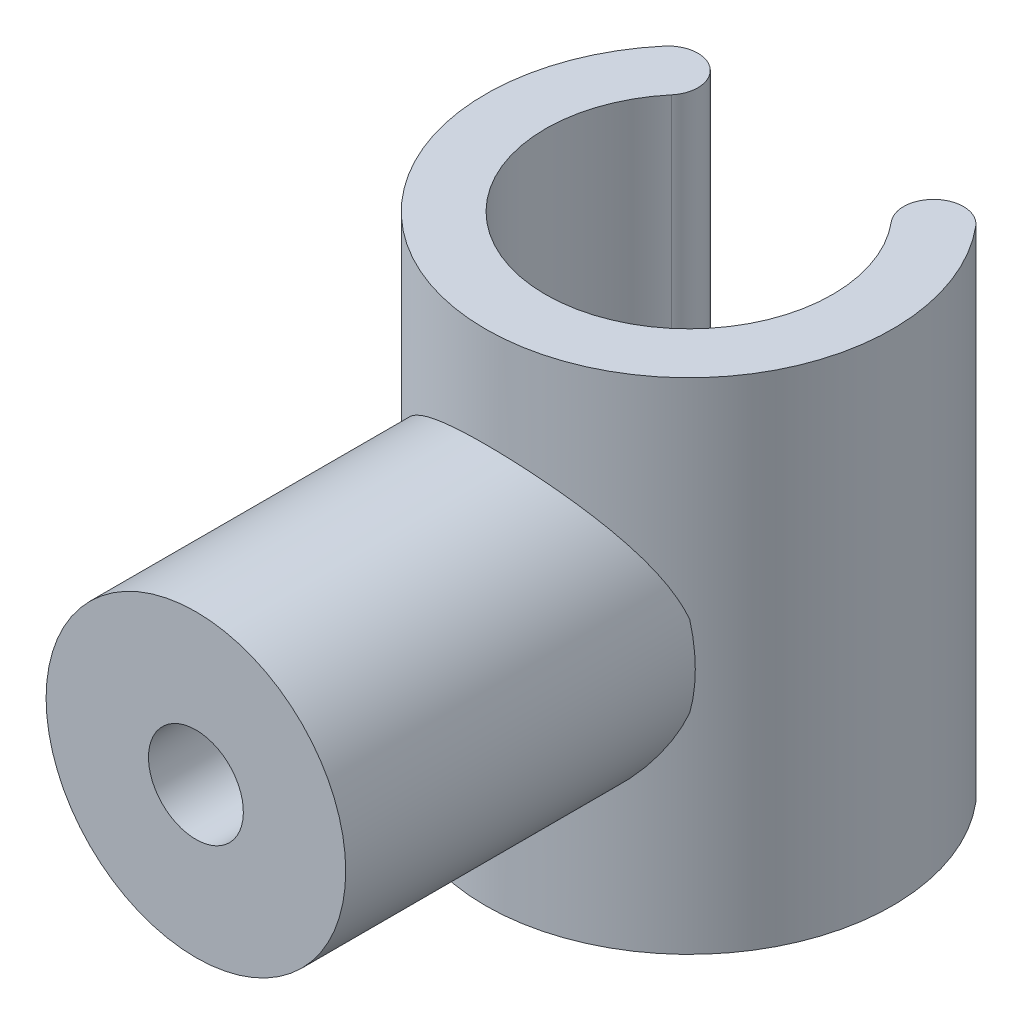
ISO-10303-21;
HEADER;
FILE_DESCRIPTION(('STEP AP214'),'2;1');
FILE_NAME('part.step','',(''),(''),'','','');
FILE_SCHEMA(('AUTOMOTIVE_DESIGN { 1 0 10303 214 1 1 1 1 }'));
ENDSEC;
DATA;
#1=APPLICATION_CONTEXT('core data for automotive mechanical design processes');
#2=APPLICATION_PROTOCOL_DEFINITION('international standard','automotive_design',2000,#1);
#3=PRODUCT_CONTEXT('',#1,'mechanical');
#4=PRODUCT('Part','Part','',(#3));
#5=PRODUCT_RELATED_PRODUCT_CATEGORY('part','',(#4));
#6=PRODUCT_DEFINITION_FORMATION('','',#4);
#7=PRODUCT_DEFINITION_CONTEXT('part definition',#1,'design');
#8=PRODUCT_DEFINITION('design','',#6,#7);
#9=PRODUCT_DEFINITION_SHAPE('','',#8);
#10=(LENGTH_UNIT() NAMED_UNIT(*) SI_UNIT(.MILLI.,.METRE.));
#11=(NAMED_UNIT(*) PLANE_ANGLE_UNIT() SI_UNIT($,.RADIAN.));
#12=(NAMED_UNIT(*) SI_UNIT($,.STERADIAN.) SOLID_ANGLE_UNIT());
#13=UNCERTAINTY_MEASURE_WITH_UNIT(LENGTH_MEASURE(1.E-05),#10,'distance_accuracy_value','');
#14=(GEOMETRIC_REPRESENTATION_CONTEXT(3) GLOBAL_UNCERTAINTY_ASSIGNED_CONTEXT((#13)) GLOBAL_UNIT_ASSIGNED_CONTEXT((#10,
#11,#12)) REPRESENTATION_CONTEXT('',''));
#15=CARTESIAN_POINT('',(0.,0.,0.));
#16=DIRECTION('',(0.,0.,1.));
#17=DIRECTION('',(1.,0.,0.));
#18=AXIS2_PLACEMENT_3D('',#15,#16,#17);
#19=CARTESIAN_POINT('',(0.,-5.,0.));
#20=DIRECTION('',(0.,-1.,0.));
#21=DIRECTION('',(1.,0.,0.));
#22=AXIS2_PLACEMENT_3D('',#19,#20,#21);
#23=PLANE('',#22);
#24=CARTESIAN_POINT('',(0.,-5.,0.));
#25=DIRECTION('',(0.,-1.,0.));
#26=DIRECTION('',(1.,0.,0.));
#27=AXIS2_PLACEMENT_3D('',#24,#25,#26);
#28=CIRCLE('',#27,4.075);
#29=CARTESIAN_POINT('',(3.11900642441656,-5.,-2.62248430394696));
#30=VERTEX_POINT('',#29);
#31=CARTESIAN_POINT('',(-3.11900642441657,-5.,-2.62248430394696));
#32=VERTEX_POINT('',#31);
#33=EDGE_CURVE('E223',#30,#32,#28,.T.);
#34=ORIENTED_EDGE('',*,*,#33,.T.);
#35=CARTESIAN_POINT('',(-2.65976621468652,-5.,-2.2363516456971));
#36=DIRECTION('',(0.,-1.,0.));
#37=DIRECTION('',(1.,0.,0.));
#38=AXIS2_PLACEMENT_3D('',#35,#36,#37);
#39=CIRCLE('',#38,0.6);
#40=CARTESIAN_POINT('',(-2.20013954881513,-5.,-2.62202421150903));
#41=VERTEX_POINT('',#40);
#42=EDGE_CURVE('E217',#32,#41,#39,.T.);
#43=ORIENTED_EDGE('',*,*,#42,.T.);
#44=CARTESIAN_POINT('',(-2.65976621468652,-5.,-2.2363516456971));
#45=DIRECTION('',(0.,-1.,0.));
#46=DIRECTION('',(1.,0.,0.));
#47=AXIS2_PLACEMENT_3D('',#44,#45,#46);
#48=CIRCLE('',#47,0.6);
#49=CARTESIAN_POINT('',(-2.20052600495647,-5.,-1.85021898744724));
#50=VERTEX_POINT('',#49);
#51=EDGE_CURVE('E62',#41,#50,#48,.T.);
#52=ORIENTED_EDGE('',*,*,#51,.T.);
#53=CARTESIAN_POINT('',(0.,-5.,0.));
#54=DIRECTION('',(0.,-1.,0.));
#55=DIRECTION('',(1.,0.,0.));
#56=AXIS2_PLACEMENT_3D('',#53,#54,#55);
#57=CIRCLE('',#56,2.875);
#58=CARTESIAN_POINT('',(2.20052600495647,-5.,-1.85021898744724));
#59=VERTEX_POINT('',#58);
#60=EDGE_CURVE('E140',#59,#50,#57,.T.);
#61=ORIENTED_EDGE('',*,*,#60,.F.);
#62=CARTESIAN_POINT('',(2.65976621468652,-5.,-2.2363516456971));
#63=DIRECTION('',(0.,-1.,0.));
#64=DIRECTION('',(1.,0.,0.));
#65=AXIS2_PLACEMENT_3D('',#62,#63,#64);
#66=CIRCLE('',#65,0.6);
#67=CARTESIAN_POINT('',(2.20013954881513,-5.,-2.62202421150903));
#68=VERTEX_POINT('',#67);
#69=EDGE_CURVE('E209',#59,#68,#66,.T.);
#70=ORIENTED_EDGE('',*,*,#69,.T.);
#71=CARTESIAN_POINT('',(2.65976621468652,-5.,-2.2363516456971));
#72=DIRECTION('',(0.,-1.,0.));
#73=DIRECTION('',(1.,0.,0.));
#74=AXIS2_PLACEMENT_3D('',#71,#72,#73);
#75=CIRCLE('',#74,0.6);
#76=EDGE_CURVE('E212',#68,#30,#75,.T.);
#77=ORIENTED_EDGE('',*,*,#76,.T.);
#78=EDGE_LOOP('',(#34,#43,#52,#61,#70,#77));
#79=FACE_BOUND('',#78,.T.);
#80=ADVANCED_FACE('F44',(#79),#23,.T.);
#81=CARTESIAN_POINT('',(0.,5.,0.));
#82=DIRECTION('',(0.,-1.,0.));
#83=DIRECTION('',(1.,0.,0.));
#84=AXIS2_PLACEMENT_3D('',#81,#82,#83);
#85=PLANE('',#84);
#86=CARTESIAN_POINT('',(-2.65976621468652,5.,-2.2363516456971));
#87=DIRECTION('',(0.,-1.,0.));
#88=DIRECTION('',(1.,0.,0.));
#89=AXIS2_PLACEMENT_3D('',#86,#87,#88);
#90=CIRCLE('',#89,0.6);
#91=CARTESIAN_POINT('',(-2.20052600495647,5.,-1.85021898744725));
#92=VERTEX_POINT('',#91);
#93=CARTESIAN_POINT('',(-2.20013954881513,5.,-2.62202421150903));
#94=VERTEX_POINT('',#93);
#95=EDGE_CURVE('E178',#92,#94,#90,.F.);
#96=ORIENTED_EDGE('',*,*,#95,.T.);
#97=CARTESIAN_POINT('',(-2.65976621468652,5.,-2.2363516456971));
#98=DIRECTION('',(0.,-1.,0.));
#99=DIRECTION('',(1.,0.,0.));
#100=AXIS2_PLACEMENT_3D('',#97,#98,#99);
#101=CIRCLE('',#100,0.6);
#102=CARTESIAN_POINT('',(-3.11900642441657,5.,-2.62248430394696));
#103=VERTEX_POINT('',#102);
#104=EDGE_CURVE('E182',#94,#103,#101,.F.);
#105=ORIENTED_EDGE('',*,*,#104,.T.);
#106=CARTESIAN_POINT('',(0.,5.,0.));
#107=DIRECTION('',(0.,-1.,0.));
#108=DIRECTION('',(1.,0.,0.));
#109=AXIS2_PLACEMENT_3D('',#106,#107,#108);
#110=CIRCLE('',#109,4.075);
#111=CARTESIAN_POINT('',(3.11900642441656,5.,-2.62248430394697));
#112=VERTEX_POINT('',#111);
#113=EDGE_CURVE('E225',#112,#103,#110,.T.);
#114=ORIENTED_EDGE('',*,*,#113,.F.);
#115=CARTESIAN_POINT('',(2.65976621468652,5.,-2.23635164569711));
#116=DIRECTION('',(0.,-1.,0.));
#117=DIRECTION('',(1.,0.,0.));
#118=AXIS2_PLACEMENT_3D('',#115,#116,#117);
#119=CIRCLE('',#118,0.6);
#120=CARTESIAN_POINT('',(2.20013954881513,5.,-2.62202421150903));
#121=VERTEX_POINT('',#120);
#122=EDGE_CURVE('E187',#112,#121,#119,.F.);
#123=ORIENTED_EDGE('',*,*,#122,.T.);
#124=CARTESIAN_POINT('',(2.65976621468652,5.,-2.23635164569711));
#125=DIRECTION('',(0.,-1.,0.));
#126=DIRECTION('',(1.,0.,0.));
#127=AXIS2_PLACEMENT_3D('',#124,#125,#126);
#128=CIRCLE('',#127,0.6);
#129=CARTESIAN_POINT('',(2.20052600495647,5.,-1.85021898744725));
#130=VERTEX_POINT('',#129);
#131=EDGE_CURVE('E233',#121,#130,#128,.F.);
#132=ORIENTED_EDGE('',*,*,#131,.T.);
#133=CARTESIAN_POINT('',(0.,5.,0.));
#134=DIRECTION('',(0.,-1.,0.));
#135=DIRECTION('',(1.,0.,0.));
#136=AXIS2_PLACEMENT_3D('',#133,#134,#135);
#137=CIRCLE('',#136,2.875);
#138=EDGE_CURVE('E135',#130,#92,#137,.T.);
#139=ORIENTED_EDGE('',*,*,#138,.T.);
#140=EDGE_LOOP('',(#96,#105,#114,#123,#132,#139));
#141=FACE_BOUND('',#140,.T.);
#142=ADVANCED_FACE('F170',(#141),#85,.F.);
#143=CARTESIAN_POINT('',(0.,-5.,0.));
#144=DIRECTION('',(0.,1.,0.));
#145=DIRECTION('',(-1.,0.,0.));
#146=AXIS2_PLACEMENT_3D('',#143,#144,#145);
#147=CYLINDRICAL_SURFACE('',#146,4.075);
#148=CARTESIAN_POINT('',(2.88790581563873,-0.812403840463599,2.875));
#149=CARTESIAN_POINT('',(2.86396987335777,-0.897453284394713,2.89904984617288));
#150=CARTESIAN_POINT('',(2.8365410358721,-0.980582858815973,2.9259981833262));
#151=CARTESIAN_POINT('',(2.77521081091253,-1.1426790618383,2.9842252696767));
#152=CARTESIAN_POINT('',(2.74132052686743,-1.2216525395088,3.01549656526744));
#153=CARTESIAN_POINT('',(2.66755311843785,-1.37528525505905,3.08094386239194));
#154=CARTESIAN_POINT('',(2.62768534592957,-1.44995098416575,3.1151152910095));
#155=CARTESIAN_POINT('',(2.54221793107529,-1.59506134909615,3.18524978771818));
#156=CARTESIAN_POINT('',(2.49661555196243,-1.66550394562205,3.22121370627193));
#157=CARTESIAN_POINT('',(2.35215234253959,-1.8695058096925,3.32977646102683));
#158=CARTESIAN_POINT('',(2.24512126426353,-1.99679729167083,3.40352574297608));
#159=CARTESIAN_POINT('',(2.01026162839675,-2.23306280346649,3.5473171158555));
#160=CARTESIAN_POINT('',(1.88242829260121,-2.34203261314063,3.61735835014989));
#161=CARTESIAN_POINT('',(1.62244812061208,-2.52789559651073,3.74053719482807));
#162=CARTESIAN_POINT('',(1.49238205711021,-2.60701306321136,3.79468919471361));
#163=CARTESIAN_POINT('',(1.21816452406372,-2.74583079814262,3.89136554152056));
#164=CARTESIAN_POINT('',(1.07402526042738,-2.80554770161209,3.93389984515969));
#165=CARTESIAN_POINT('',(0.849133978576695,-2.87841739896584,3.98630590120425));
#166=CARTESIAN_POINT('',(0.772342912189284,-2.89998413772647,4.00192127508929));
#167=CARTESIAN_POINT('',(0.616587043103844,-2.93704195364046,4.02885537442209));
#168=CARTESIAN_POINT('',(0.537623375764297,-2.95253614199359,4.04017629998419));
#169=CARTESIAN_POINT('',(0.378214827153008,-2.9771552833664,4.05820257518367));
#170=CARTESIAN_POINT('',(0.297770523200099,-2.98628266705923,4.06490968623662));
#171=CARTESIAN_POINT('',(0.136180671361998,-2.99800395355235,4.07352912946396));
#172=CARTESIAN_POINT('',(0.0550352227760893,-3.00059876678596,4.07544212978531));
#173=CARTESIAN_POINT('',(-0.166424725485071,-2.99865452277607,4.07400718415628));
#174=CARTESIAN_POINT('',(-0.306732934675275,-2.98753283705214,4.06580511493588));
#175=CARTESIAN_POINT('',(-0.582841730451785,-2.94615546987724,4.03550076286465));
#176=CARTESIAN_POINT('',(-0.718641941200782,-2.91589819726477,4.01339732408859));
#177=CARTESIAN_POINT('',(-0.981296699021089,-2.83824899253106,3.95734353287424));
#178=CARTESIAN_POINT('',(-1.10821751309609,-2.7910049986219,3.92349555063636));
#179=CARTESIAN_POINT('',(-1.35211950668457,-2.68135662622725,3.84626903740088));
#180=CARTESIAN_POINT('',(-1.46910013379195,-2.61895140592957,3.80288997721233));
#181=CARTESIAN_POINT('',(-1.70756308655748,-2.47115220306957,3.70254811320194));
#182=CARTESIAN_POINT('',(-1.8273544699331,-2.38375748511809,3.64453242110091));
#183=CARTESIAN_POINT('',(-2.05157956416729,-2.19378235083266,3.52319879903805));
#184=CARTESIAN_POINT('',(-2.15598082321219,-2.09117073608246,3.45987009474344));
#185=CARTESIAN_POINT('',(-2.30973124710229,-1.91643096155526,3.3579059581445));
#186=CARTESIAN_POINT('',(-2.36432373066228,-1.84865961741318,3.31959248315098));
#187=CARTESIAN_POINT('',(-2.46757347071481,-1.70841353961342,3.24358277328851));
#188=CARTESIAN_POINT('',(-2.51622850859452,-1.63593706321784,3.20588677367565));
#189=CARTESIAN_POINT('',(-2.65265498041123,-1.41204032010555,3.09557520389261));
#190=CARTESIAN_POINT('',(-2.73143027027953,-1.25353890980507,3.02535910804588));
#191=CARTESIAN_POINT('',(-2.81358767936852,-1.04211498087328,2.94786908207971));
#192=CARTESIAN_POINT('',(-2.82989564809637,-0.997002922802062,2.93219709791875));
#193=CARTESIAN_POINT('',(-2.86045906191798,-0.905590905107362,2.90238628679099));
#194=CARTESIAN_POINT('',(-2.8747143759611,-0.85929086986026,2.88824755772824));
#195=CARTESIAN_POINT('',(-2.88790581563873,-0.812403840463599,2.875));
#196=B_SPLINE_CURVE_WITH_KNOTS('',3,(#148,#149,#150,#151,#152,#153,#154,#155,#156,#157,#158,
#159,#160,#161,#162,#163,#164,#165,#166,#167,#168,#169,#170,#171,#172,#173,#174,#175,#176,#177,
#178,#179,#180,#181,#182,#183,#184,#185,#186,#187,#188,#189,#190,#191,#192,#193,#194,#195),
.UNSPECIFIED.,.F.,.F.,(4,2,2,2,2,2,2,2,2,2,2,2,2,2,2,2,2,2,2,2,2,2,2,4),(0.,0.27441510762216,
0.54836283922251,0.821886363208285,1.09554092170355,1.63907956269224,2.18274322926595,
2.66561366767767,3.14806896364641,3.3915877967518,3.63498170223898,3.87828263560953,
4.12154965866139,4.54222622834102,4.96293778270041,5.38007072589025,5.7972268352725,
6.2732018086239,6.75016649740683,7.03512834484124,7.32019634846556,7.8876538296769,
8.03899172374996,8.19033927562882),.UNSPECIFIED.);
#197=CARTESIAN_POINT('',(2.88790581563873,-0.812403840463599,2.875));
#198=VERTEX_POINT('',#197);
#199=CARTESIAN_POINT('',(-2.88790581563873,-0.812403840463599,2.875));
#200=VERTEX_POINT('',#199);
#201=EDGE_CURVE('E127',#198,#200,#196,.T.);
#202=ORIENTED_EDGE('',*,*,#201,.T.);
#203=DIRECTION('',(0.,1.,0.));
#204=VECTOR('',#203,1.);
#205=CARTESIAN_POINT('',(-2.88790581563873,-5.,2.875));
#206=LINE('',#205,#204);
#207=CARTESIAN_POINT('',(-2.88790581563873,0.8124038404636,2.875));
#208=VERTEX_POINT('',#207);
#209=EDGE_CURVE('E119',#200,#208,#206,.T.);
#210=ORIENTED_EDGE('',*,*,#209,.T.);
#211=CARTESIAN_POINT('',(-2.88790581563873,0.8124038404636,2.875));
#212=CARTESIAN_POINT('',(-2.86396987335777,0.897453284394714,2.89904984617288));
#213=CARTESIAN_POINT('',(-2.8365410358721,0.980582858815974,2.9259981833262));
#214=CARTESIAN_POINT('',(-2.77521081091253,1.14267906183831,2.9842252696767));
#215=CARTESIAN_POINT('',(-2.74132052686743,1.2216525395088,3.01549656526744));
#216=CARTESIAN_POINT('',(-2.66755311843785,1.37528525505905,3.08094386239194));
#217=CARTESIAN_POINT('',(-2.62768534592957,1.44995098416575,3.1151152910095));
#218=CARTESIAN_POINT('',(-2.54221793107529,1.59506134909615,3.18524978771818));
#219=CARTESIAN_POINT('',(-2.49661555196243,1.66550394562205,3.22121370627193));
#220=CARTESIAN_POINT('',(-2.35215234253959,1.8695058096925,3.32977646102683));
#221=CARTESIAN_POINT('',(-2.24512126426353,1.99679729167083,3.40352574297608));
#222=CARTESIAN_POINT('',(-2.01026162839675,2.23306280346649,3.5473171158555));
#223=CARTESIAN_POINT('',(-1.88242829260121,2.34203261314063,3.61735835014989));
#224=CARTESIAN_POINT('',(-1.62244812061208,2.52789559651073,3.74053719482807));
#225=CARTESIAN_POINT('',(-1.49238205711021,2.60701306321136,3.79468919471361));
#226=CARTESIAN_POINT('',(-1.21816452406372,2.74583079814262,3.89136554152056));
#227=CARTESIAN_POINT('',(-1.07402526042738,2.80554770161209,3.93389984515969));
#228=CARTESIAN_POINT('',(-0.849133978576695,2.87841739896584,3.98630590120425));
#229=CARTESIAN_POINT('',(-0.772342912189283,2.89998413772647,4.00192127508929));
#230=CARTESIAN_POINT('',(-0.616587043103844,2.93704195364046,4.02885537442209));
#231=CARTESIAN_POINT('',(-0.537623375764296,2.95253614199359,4.04017629998419));
#232=CARTESIAN_POINT('',(-0.378214827153008,2.9771552833664,4.05820257518367));
#233=CARTESIAN_POINT('',(-0.297770523200098,2.98628266705923,4.06490968623662));
#234=CARTESIAN_POINT('',(-0.136180671361998,2.99800395355235,4.07352912946396));
#235=CARTESIAN_POINT('',(-0.0550352227760893,3.00059876678596,4.07544212978531));
#236=CARTESIAN_POINT('',(0.166424725485071,2.99865452277607,4.07400718415628));
#237=CARTESIAN_POINT('',(0.306732934675275,2.98753283705214,4.06580511493588));
#238=CARTESIAN_POINT('',(0.582841730451785,2.94615546987724,4.03550076286465));
#239=CARTESIAN_POINT('',(0.718641941200782,2.91589819726477,4.01339732408859));
#240=CARTESIAN_POINT('',(0.981296699021089,2.83824899253106,3.95734353287424));
#241=CARTESIAN_POINT('',(1.10821751309609,2.7910049986219,3.92349555063636));
#242=CARTESIAN_POINT('',(1.35211950668457,2.68135662622725,3.84626903740088));
#243=CARTESIAN_POINT('',(1.46910013379195,2.61895140592957,3.80288997721233));
#244=CARTESIAN_POINT('',(1.70756308655748,2.47115220306957,3.70254811320194));
#245=CARTESIAN_POINT('',(1.8273544699331,2.38375748511809,3.64453242110091));
#246=CARTESIAN_POINT('',(2.05157956416729,2.19378235083266,3.52319879903805));
#247=CARTESIAN_POINT('',(2.15598082321219,2.09117073608246,3.45987009474344));
#248=CARTESIAN_POINT('',(2.30973124710229,1.91643096155526,3.3579059581445));
#249=CARTESIAN_POINT('',(2.36432373066228,1.84865961741318,3.31959248315098));
#250=CARTESIAN_POINT('',(2.46757347071481,1.70841353961342,3.24358277328851));
#251=CARTESIAN_POINT('',(2.51622850859452,1.63593706321784,3.20588677367565));
#252=CARTESIAN_POINT('',(2.65265498041123,1.41204032010555,3.09557520389261));
#253=CARTESIAN_POINT('',(2.73143027027953,1.25353890980507,3.02535910804588));
#254=CARTESIAN_POINT('',(2.81358767936852,1.04211498087328,2.94786908207971));
#255=CARTESIAN_POINT('',(2.82989564809637,0.997002922802063,2.93219709791875));
#256=CARTESIAN_POINT('',(2.86045906191798,0.905590905107363,2.90238628679099));
#257=CARTESIAN_POINT('',(2.8747143759611,0.85929086986026,2.88824755772824));
#258=CARTESIAN_POINT('',(2.88790581563873,0.812403840463599,2.875));
#259=B_SPLINE_CURVE_WITH_KNOTS('',3,(#211,#212,#213,#214,#215,#216,#217,#218,#219,#220,#221,
#222,#223,#224,#225,#226,#227,#228,#229,#230,#231,#232,#233,#234,#235,#236,#237,#238,#239,#240,
#241,#242,#243,#244,#245,#246,#247,#248,#249,#250,#251,#252,#253,#254,#255,#256,#257,#258),
.UNSPECIFIED.,.F.,.F.,(4,2,2,2,2,2,2,2,2,2,2,2,2,2,2,2,2,2,2,2,2,2,2,4),(0.,0.27441510762216,
0.54836283922251,0.821886363208286,1.09554092170355,1.63907956269224,2.18274322926595,
2.66561366767767,3.14806896364641,3.3915877967518,3.63498170223898,3.87828263560953,
4.12154965866139,4.54222622834102,4.96293778270041,5.38007072589025,5.7972268352725,
6.2732018086239,6.75016649740683,7.03512834484124,7.32019634846556,7.8876538296769,
8.03899172374996,8.19033927562882),.UNSPECIFIED.);
#260=CARTESIAN_POINT('',(2.88790581563873,0.8124038404636,2.875));
#261=VERTEX_POINT('',#260);
#262=EDGE_CURVE('E125',#208,#261,#259,.T.);
#263=ORIENTED_EDGE('',*,*,#262,.T.);
#264=DIRECTION('',(0.,1.,0.));
#265=VECTOR('',#264,1.);
#266=CARTESIAN_POINT('',(2.88790581563873,-5.,2.875));
#267=LINE('',#266,#265);
#268=EDGE_CURVE('E110',#261,#198,#267,.F.);
#269=ORIENTED_EDGE('',*,*,#268,.T.);
#270=EDGE_LOOP('',(#202,#210,#263,#269));
#271=FACE_BOUND('',#270,.T.);
#272=ORIENTED_EDGE('',*,*,#113,.T.);
#273=DIRECTION('',(0.,1.,0.));
#274=VECTOR('',#273,1.);
#275=CARTESIAN_POINT('',(-3.11900642441657,-5.,-2.62248430394696));
#276=LINE('',#275,#274);
#277=EDGE_CURVE('E198',#103,#32,#276,.F.);
#278=ORIENTED_EDGE('',*,*,#277,.T.);
#279=ORIENTED_EDGE('',*,*,#33,.F.);
#280=DIRECTION('',(0.,1.,0.));
#281=VECTOR('',#280,1.);
#282=CARTESIAN_POINT('',(3.11900642441656,-5.,-2.62248430394696));
#283=LINE('',#282,#281);
#284=EDGE_CURVE('E200',#30,#112,#283,.T.);
#285=ORIENTED_EDGE('',*,*,#284,.T.);
#286=EDGE_LOOP('',(#272,#278,#279,#285));
#287=FACE_BOUND('',#286,.T.);
#288=ADVANCED_FACE('F132',(#271,#287),#147,.T.);
#289=CARTESIAN_POINT('',(0.,-5.,0.));
#290=DIRECTION('',(0.,1.,0.));
#291=DIRECTION('',(-1.,0.,0.));
#292=AXIS2_PLACEMENT_3D('',#289,#290,#291);
#293=CYLINDRICAL_SURFACE('',#292,2.875);
#294=ORIENTED_EDGE('',*,*,#60,.T.);
#295=DIRECTION('',(0.,1.,0.));
#296=VECTOR('',#295,1.);
#297=CARTESIAN_POINT('',(-2.20052600495647,-5.,-1.85021898744724));
#298=LINE('',#297,#296);
#299=EDGE_CURVE('E11',#50,#92,#298,.T.);
#300=ORIENTED_EDGE('',*,*,#299,.T.);
#301=ORIENTED_EDGE('',*,*,#138,.F.);
#302=DIRECTION('',(0.,1.,0.));
#303=VECTOR('',#302,1.);
#304=CARTESIAN_POINT('',(2.20052600495647,-5.,-1.85021898744724));
#305=LINE('',#304,#303);
#306=EDGE_CURVE('E54',#130,#59,#305,.F.);
#307=ORIENTED_EDGE('',*,*,#306,.T.);
#308=EDGE_LOOP('',(#294,#300,#301,#307));
#309=FACE_BOUND('',#308,.T.);
#310=ADVANCED_FACE('F163',(#309),#293,.F.);
#311=CARTESIAN_POINT('',(0.,0.,9.875));
#312=DIRECTION('',(0.,0.,-1.));
#313=DIRECTION('',(0.,1.,0.));
#314=AXIS2_PLACEMENT_3D('',#311,#312,#313);
#315=CYLINDRICAL_SURFACE('',#314,3.);
#316=CARTESIAN_POINT('',(0.,0.,9.875));
#317=DIRECTION('',(0.,0.,-1.));
#318=DIRECTION('',(0.,1.,0.));
#319=AXIS2_PLACEMENT_3D('',#316,#317,#318);
#320=CIRCLE('',#319,3.);
#321=CARTESIAN_POINT('',(0.,3.,9.875));
#322=VERTEX_POINT('',#321);
#323=EDGE_CURVE('E120',#322,#322,#320,.T.);
#324=ORIENTED_EDGE('',*,*,#323,.T.);
#325=EDGE_LOOP('',(#324));
#326=FACE_BOUND('',#325,.T.);
#327=ORIENTED_EDGE('',*,*,#262,.F.);
#328=CARTESIAN_POINT('',(0.,0.,2.875));
#329=DIRECTION('',(0.,0.,-1.));
#330=DIRECTION('',(0.,1.,0.));
#331=AXIS2_PLACEMENT_3D('',#328,#329,#330);
#332=CIRCLE('',#331,3.);
#333=EDGE_CURVE('E129',#200,#208,#332,.T.);
#334=ORIENTED_EDGE('',*,*,#333,.F.);
#335=ORIENTED_EDGE('',*,*,#201,.F.);
#336=EDGE_CURVE('E113',#261,#198,#332,.T.);
#337=ORIENTED_EDGE('',*,*,#336,.F.);
#338=EDGE_LOOP('',(#327,#334,#335,#337));
#339=FACE_BOUND('',#338,.T.);
#340=ADVANCED_FACE('F123',(#326,#339),#315,.T.);
#341=CARTESIAN_POINT('',(0.,0.,2.875));
#342=DIRECTION('',(0.,0.,-1.));
#343=DIRECTION('',(0.,1.,0.));
#344=AXIS2_PLACEMENT_3D('',#341,#342,#343);
#345=PLANE('',#344);
#346=ORIENTED_EDGE('',*,*,#209,.F.);
#347=ORIENTED_EDGE('',*,*,#333,.T.);
#348=EDGE_LOOP('',(#346,#347));
#349=FACE_BOUND('',#348,.T.);
#350=ADVANCED_FACE('F162',(#349),#345,.T.);
#351=ORIENTED_EDGE('',*,*,#268,.F.);
#352=ORIENTED_EDGE('',*,*,#336,.T.);
#353=EDGE_LOOP('',(#351,#352));
#354=FACE_BOUND('',#353,.T.);
#355=ADVANCED_FACE('F112',(#354),#345,.T.);
#356=CARTESIAN_POINT('',(0.,0.,9.875));
#357=DIRECTION('',(0.,0.,-1.));
#358=DIRECTION('',(0.,1.,0.));
#359=AXIS2_PLACEMENT_3D('',#356,#357,#358);
#360=CYLINDRICAL_SURFACE('',#359,0.95);
#361=CARTESIAN_POINT('',(0.,0.,9.875));
#362=DIRECTION('',(0.,0.,-1.));
#363=DIRECTION('',(0.,1.,0.));
#364=AXIS2_PLACEMENT_3D('',#361,#362,#363);
#365=CIRCLE('',#364,0.95);
#366=CARTESIAN_POINT('',(0.,0.950000000000001,9.875));
#367=VERTEX_POINT('',#366);
#368=EDGE_CURVE('E194',#367,#367,#365,.T.);
#369=ORIENTED_EDGE('',*,*,#368,.F.);
#370=EDGE_LOOP('',(#369));
#371=FACE_BOUND('',#370,.T.);
#372=CARTESIAN_POINT('',(0.,0.950000000000001,4.075));
#373=CARTESIAN_POINT('',(0.0525998624309189,0.949998335742757,4.07499905262148));
#374=CARTESIAN_POINT('',(0.105219126932674,0.945616724803785,4.07397130569958));
#375=CARTESIAN_POINT('',(0.208957021002395,0.928227813041077,4.06997082053608));
#376=CARTESIAN_POINT('',(0.260074654670637,0.915214916955119,4.06699682064558));
#377=CARTESIAN_POINT('',(0.359295595901938,0.880997903557039,4.05943416059737));
#378=CARTESIAN_POINT('',(0.40740219478159,0.859802918328539,4.05484730106991));
#379=CARTESIAN_POINT('',(0.499375881787197,0.809853788860266,4.04455104201564));
#380=CARTESIAN_POINT('',(0.543242965138958,0.781099636108117,4.03884164122474));
#381=CARTESIAN_POINT('',(0.626286570945984,0.716298566517449,4.02680781778389));
#382=CARTESIAN_POINT('',(0.665375469549095,0.680140923813907,4.02047492141353));
#383=CARTESIAN_POINT('',(0.736992520533975,0.601796680153179,4.00796602449657));
#384=CARTESIAN_POINT('',(0.769520022004527,0.559609481753694,4.00179003956916));
#385=CARTESIAN_POINT('',(0.827488846096512,0.46974134004243,3.9902098911001));
#386=CARTESIAN_POINT('',(0.852834781297754,0.421997348636823,3.9848165430208));
#387=CARTESIAN_POINT('',(0.895108452464439,0.322780773912883,3.97553485972995));
#388=CARTESIAN_POINT('',(0.912037343679232,0.271308703389506,3.97164631799819));
#389=CARTESIAN_POINT('',(0.936702616561624,0.167053547716667,3.96590119702645));
#390=CARTESIAN_POINT('',(0.944595235064205,0.114309368805398,3.96401012753525));
#391=CARTESIAN_POINT('',(0.9514501132755,0.00821425041043636,3.96237063858447));
#392=CARTESIAN_POINT('',(0.950413626603418,-0.045136602847683,3.9626219183455));
#393=CARTESIAN_POINT('',(0.939564965824083,-0.149753403925175,3.96520760858529));
#394=CARTESIAN_POINT('',(0.929936335098498,-0.20103962729872,3.96749844813137));
#395=CARTESIAN_POINT('',(0.90246838609377,-0.301248076929689,3.9738360079225));
#396=CARTESIAN_POINT('',(0.884628551444128,-0.35017015430139,3.97788283859405));
#397=CARTESIAN_POINT('',(0.841081517604806,-0.444766936510303,3.9873180220354));
#398=CARTESIAN_POINT('',(0.815305518232316,-0.490408758901067,3.99271802637739));
#399=CARTESIAN_POINT('',(0.756666094579172,-0.57678627893594,4.00424422493022));
#400=CARTESIAN_POINT('',(0.723801580955594,-0.617521221003282,4.01037053069178));
#401=CARTESIAN_POINT('',(0.65095570380109,-0.693983273927885,4.02284445881728));
#402=CARTESIAN_POINT('',(0.610818778593353,-0.729562061912738,4.02919381267566));
#403=CARTESIAN_POINT('',(0.525074057783521,-0.793509658088923,4.04126140774059));
#404=CARTESIAN_POINT('',(0.479466135174773,-0.821878298852348,4.04697963428989));
#405=CARTESIAN_POINT('',(0.38387945737366,-0.870644789582753,4.0571634042079));
#406=CARTESIAN_POINT('',(0.333889348970586,-0.891021139120116,4.06162555959146));
#407=CARTESIAN_POINT('',(0.231066952301886,-0.923041808527246,4.06876953408636));
#408=CARTESIAN_POINT('',(0.178235136551788,-0.934687575326283,4.07145164819748));
#409=CARTESIAN_POINT('',(0.0724994326893882,-0.948695982210822,4.07469060491146));
#410=CARTESIAN_POINT('',(0.0196237304839753,-0.95126094567904,4.0752937592484));
#411=CARTESIAN_POINT('',(-0.0858008567042663,-0.947586227747198,4.07443756074263));
#412=CARTESIAN_POINT('',(-0.138349766729838,-0.941347229575775,4.0729783679477));
#413=CARTESIAN_POINT('',(-0.240944176324848,-0.920409072983727,4.06819086455392));
#414=CARTESIAN_POINT('',(-0.291012934738702,-0.905817931842153,4.06488643132828));
#415=CARTESIAN_POINT('',(-0.387991223972339,-0.868711119084567,4.0567792447074));
#416=CARTESIAN_POINT('',(-0.434900461338534,-0.8461947125826,4.05197635236926));
#417=CARTESIAN_POINT('',(-0.525050750071185,-0.793468164847302,4.04129210067459));
#418=CARTESIAN_POINT('',(-0.568221793729269,-0.763141623131191,4.03539483942652));
#419=CARTESIAN_POINT('',(-0.648934402755282,-0.695806900152632,4.02320496418701));
#420=CARTESIAN_POINT('',(-0.686475128805936,-0.658797724511745,4.01691229144917));
#421=CARTESIAN_POINT('',(-0.755676661195492,-0.578214572466825,4.004477791888));
#422=CARTESIAN_POINT('',(-0.787196493276523,-0.534518425332435,3.99834196032453));
#423=CARTESIAN_POINT('',(-0.842452841784651,-0.442335220194861,3.98706617241653));
#424=CARTESIAN_POINT('',(-0.866189705359668,-0.393848375999279,3.9819261716586));
#425=CARTESIAN_POINT('',(-0.905036744330567,-0.293724872543088,3.97327695874396));
#426=CARTESIAN_POINT('',(-0.92019729456006,-0.242108620503522,3.96975824673639));
#427=CARTESIAN_POINT('',(-0.941603317805263,-0.136967203353161,3.96473597092385));
#428=CARTESIAN_POINT('',(-0.94785044374726,-0.083442394057195,3.9632320334975));
#429=CARTESIAN_POINT('',(-0.951174643453273,0.0225697995046739,3.96243536747719));
#430=CARTESIAN_POINT('',(-0.948475980538417,0.0750498660427436,3.96308855991381));
#431=CARTESIAN_POINT('',(-0.934491863015633,0.178784923036098,3.9664090350613));
#432=CARTESIAN_POINT('',(-0.923206539535282,0.230039932187004,3.96907628701529));
#433=CARTESIAN_POINT('',(-0.892484286843123,0.329662552940623,3.9760962630525));
#434=CARTESIAN_POINT('',(-0.873084204243071,0.378042101059942,3.98044136178494));
#435=CARTESIAN_POINT('',(-0.826713351150252,0.470891506990098,3.99032950889686));
#436=CARTESIAN_POINT('',(-0.799741671666754,0.515360894533265,3.99587270109233));
#437=CARTESIAN_POINT('',(-0.738267626793528,0.600223613903483,4.00769074114804));
#438=CARTESIAN_POINT('',(-0.703607279372202,0.64050060065987,4.01397941223229));
#439=CARTESIAN_POINT('',(-0.628054568286043,0.714739866439728,4.02649176315098));
#440=CARTESIAN_POINT('',(-0.587160752087374,0.748700669549389,4.03271542747532));
#441=CARTESIAN_POINT('',(-0.499552920844796,0.809841611820338,4.04450895771068));
#442=CARTESIAN_POINT('',(-0.452759967149648,0.836910975565793,4.05006746274922));
#443=CARTESIAN_POINT('',(-0.355165510342192,0.882756558826558,4.05978805000212));
#444=CARTESIAN_POINT('',(-0.304367191941307,0.901539290303414,4.06395122809872));
#445=CARTESIAN_POINT('',(-0.211314425331693,0.92717686170763,4.06972522072953));
#446=CARTESIAN_POINT('',(-0.169538432511249,0.93571827113987,4.07169042898664));
#447=CARTESIAN_POINT('',(-0.0851791704340699,0.947130353358675,4.07432816556661));
#448=CARTESIAN_POINT('',(-0.0425959470964269,0.95000134773382,4.07500076719755));
#449=CARTESIAN_POINT('',(0.,0.950000000000001,4.075));
#450=B_SPLINE_CURVE_WITH_KNOTS('',3,(#372,#373,#374,#375,#376,#377,#378,#379,#380,#381,#382,
#383,#384,#385,#386,#387,#388,#389,#390,#391,#392,#393,#394,#395,#396,#397,#398,#399,#400,#401,
#402,#403,#404,#405,#406,#407,#408,#409,#410,#411,#412,#413,#414,#415,#416,#417,#418,#419,#420,
#421,#422,#423,#424,#425,#426,#427,#428,#429,#430,#431,#432,#433,#434,#435,#436,#437,#438,#439,
#440,#441,#442,#443,#444,#445,#446,#447,#448,#449),.UNSPECIFIED.,.T.,.F.,(4,2,2,2,2,2,2,2,2,2,2,
2,2,2,2,2,2,2,2,2,2,2,2,2,2,2,2,2,2,2,2,2,2,2,2,2,2,2,4),(0.,0.157643590657339,
0.315389474357462,0.47295980349944,0.630530310082085,0.790656662695874,0.950798892543418,
1.11297789534769,1.2751346327411,1.4344432103415,1.59372942186675,1.74969235361312,
1.90566509459859,2.06302999555312,2.22041909715531,2.38169071939355,2.54296608620211,
2.70467237952628,2.86635186715686,3.02440558714638,3.18244704210187,3.33848931167995,
3.49454605440062,3.65307878762231,3.81163513004314,3.97354114123642,4.13543992986635,
4.29637762506836,4.45728547172639,4.6141903037897,4.77109273979492,4.92729033426203,
5.08350668869902,5.24329229860112,5.40311519910698,5.56536460544426,5.72748628171654,
5.85515503595324,5.98281654945149),.UNSPECIFIED.);
#451=CARTESIAN_POINT('',(0.,0.950000000000001,4.075));
#452=VERTEX_POINT('',#451);
#453=EDGE_CURVE('E230',#452,#452,#450,.T.);
#454=ORIENTED_EDGE('',*,*,#453,.T.);
#455=EDGE_LOOP('',(#454));
#456=FACE_BOUND('',#455,.T.);
#457=ADVANCED_FACE('F260',(#371,#456),#360,.F.);
#458=CARTESIAN_POINT('',(0.,0.,9.875));
#459=DIRECTION('',(0.,0.,-1.));
#460=DIRECTION('',(0.,1.,0.));
#461=AXIS2_PLACEMENT_3D('',#458,#459,#460);
#462=PLANE('',#461);
#463=ORIENTED_EDGE('',*,*,#368,.T.);
#464=EDGE_LOOP('',(#463));
#465=FACE_BOUND('',#464,.T.);
#466=ORIENTED_EDGE('',*,*,#323,.F.);
#467=EDGE_LOOP('',(#466));
#468=FACE_BOUND('',#467,.T.);
#469=ADVANCED_FACE('F263',(#465,#468),#462,.F.);
#470=ORIENTED_EDGE('',*,*,#453,.F.);
#471=EDGE_LOOP('',(#470));
#472=FACE_BOUND('',#471,.T.);
#473=ADVANCED_FACE('F176',(#472),#147,.T.);
#474=CARTESIAN_POINT('',(-2.65976621468652,-5.,-2.2363516456971));
#475=DIRECTION('',(0.,1.,0.));
#476=DIRECTION('',(-1.,0.,0.));
#477=AXIS2_PLACEMENT_3D('',#474,#475,#476);
#478=CYLINDRICAL_SURFACE('',#477,0.6);
#479=ORIENTED_EDGE('',*,*,#299,.F.);
#480=ORIENTED_EDGE('',*,*,#51,.F.);
#481=DIRECTION('',(0.,-1.,0.));
#482=VECTOR('',#481,1.);
#483=CARTESIAN_POINT('',(-2.20013954881513,-5.,-2.62202421150903));
#484=LINE('',#483,#482);
#485=EDGE_CURVE('E190',#94,#41,#484,.T.);
#486=ORIENTED_EDGE('',*,*,#485,.F.);
#487=ORIENTED_EDGE('',*,*,#95,.F.);
#488=EDGE_LOOP('',(#479,#480,#486,#487));
#489=FACE_BOUND('',#488,.T.);
#490=ADVANCED_FACE('F191',(#489),#478,.T.);
#491=CARTESIAN_POINT('',(-2.65976621468652,-5.,-2.2363516456971));
#492=DIRECTION('',(0.,1.,0.));
#493=DIRECTION('',(-1.,0.,0.));
#494=AXIS2_PLACEMENT_3D('',#491,#492,#493);
#495=CYLINDRICAL_SURFACE('',#494,0.6);
#496=ORIENTED_EDGE('',*,*,#42,.F.);
#497=ORIENTED_EDGE('',*,*,#277,.F.);
#498=ORIENTED_EDGE('',*,*,#104,.F.);
#499=ORIENTED_EDGE('',*,*,#485,.T.);
#500=EDGE_LOOP('',(#496,#497,#498,#499));
#501=FACE_BOUND('',#500,.T.);
#502=ADVANCED_FACE('F196',(#501),#495,.T.);
#503=CARTESIAN_POINT('',(2.65976621468652,-5.,-2.2363516456971));
#504=DIRECTION('',(0.,1.,0.));
#505=DIRECTION('',(-1.,0.,0.));
#506=AXIS2_PLACEMENT_3D('',#503,#504,#505);
#507=CYLINDRICAL_SURFACE('',#506,0.6);
#508=DIRECTION('',(0.,-1.,0.));
#509=VECTOR('',#508,1.);
#510=CARTESIAN_POINT('',(2.20013954881513,5.,-2.62202421150903));
#511=LINE('',#510,#509);
#512=EDGE_CURVE('E48',#68,#121,#511,.F.);
#513=ORIENTED_EDGE('',*,*,#512,.F.);
#514=ORIENTED_EDGE('',*,*,#69,.F.);
#515=ORIENTED_EDGE('',*,*,#306,.F.);
#516=ORIENTED_EDGE('',*,*,#131,.F.);
#517=EDGE_LOOP('',(#513,#514,#515,#516));
#518=FACE_BOUND('',#517,.T.);
#519=ADVANCED_FACE('F46',(#518),#507,.T.);
#520=CARTESIAN_POINT('',(2.65976621468652,-5.,-2.2363516456971));
#521=DIRECTION('',(0.,1.,0.));
#522=DIRECTION('',(-1.,0.,0.));
#523=AXIS2_PLACEMENT_3D('',#520,#521,#522);
#524=CYLINDRICAL_SURFACE('',#523,0.6);
#525=ORIENTED_EDGE('',*,*,#76,.F.);
#526=ORIENTED_EDGE('',*,*,#512,.T.);
#527=ORIENTED_EDGE('',*,*,#122,.F.);
#528=ORIENTED_EDGE('',*,*,#284,.F.);
#529=EDGE_LOOP('',(#525,#526,#527,#528));
#530=FACE_BOUND('',#529,.T.);
#531=ADVANCED_FACE('F243',(#530),#524,.T.);
#532=CLOSED_SHELL('',(#80,#142,#288,#310,#340,#350,#355,#457,#469,#473,#490,#502,#519,#531));
#533=MANIFOLD_SOLID_BREP('B2',#532);
#534=ADVANCED_BREP_SHAPE_REPRESENTATION('',(#18,#533),#14);
#535=SHAPE_DEFINITION_REPRESENTATION(#9,#534);
ENDSEC;
END-ISO-10303-21;
